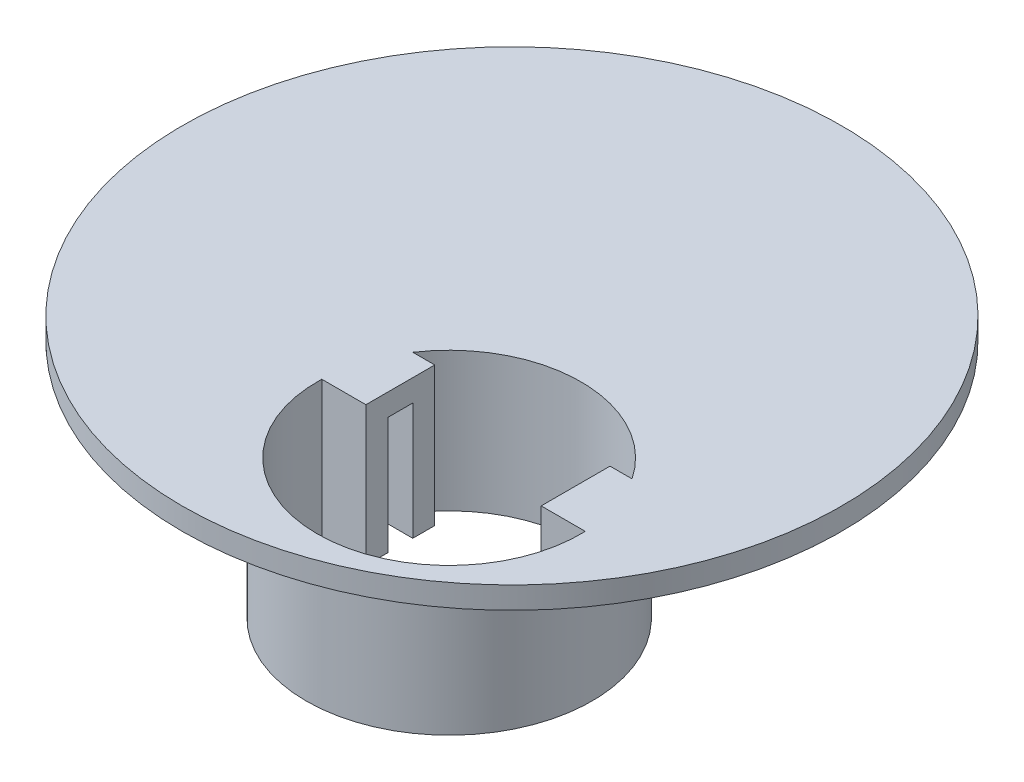
ISO-10303-21;
HEADER;
FILE_DESCRIPTION(('STEP AP214'),'2;1');
FILE_NAME('part.step','',(''),(''),'','','');
FILE_SCHEMA(('AUTOMOTIVE_DESIGN { 1 0 10303 214 1 1 1 1 }'));
ENDSEC;
DATA;
#1=APPLICATION_CONTEXT('core data for automotive mechanical design processes');
#2=APPLICATION_PROTOCOL_DEFINITION('international standard','automotive_design',2000,#1);
#3=PRODUCT_CONTEXT('',#1,'mechanical');
#4=PRODUCT('Part','Part','',(#3));
#5=PRODUCT_RELATED_PRODUCT_CATEGORY('part','',(#4));
#6=PRODUCT_DEFINITION_FORMATION('','',#4);
#7=PRODUCT_DEFINITION_CONTEXT('part definition',#1,'design');
#8=PRODUCT_DEFINITION('design','',#6,#7);
#9=PRODUCT_DEFINITION_SHAPE('','',#8);
#10=(LENGTH_UNIT() NAMED_UNIT(*) SI_UNIT(.MILLI.,.METRE.));
#11=(NAMED_UNIT(*) PLANE_ANGLE_UNIT() SI_UNIT($,.RADIAN.));
#12=(NAMED_UNIT(*) SI_UNIT($,.STERADIAN.) SOLID_ANGLE_UNIT());
#13=UNCERTAINTY_MEASURE_WITH_UNIT(LENGTH_MEASURE(1.E-05),#10,'distance_accuracy_value','');
#14=(GEOMETRIC_REPRESENTATION_CONTEXT(3) GLOBAL_UNCERTAINTY_ASSIGNED_CONTEXT((#13)) GLOBAL_UNIT_ASSIGNED_CONTEXT((#10,
#11,#12)) REPRESENTATION_CONTEXT('',''));
#15=CARTESIAN_POINT('',(0.,0.,0.));
#16=DIRECTION('',(0.,0.,1.));
#17=DIRECTION('',(1.,0.,0.));
#18=AXIS2_PLACEMENT_3D('',#15,#16,#17);
#19=CARTESIAN_POINT('',(0.,0.,0.));
#20=DIRECTION('',(0.,1.,0.));
#21=DIRECTION('',(0.,0.,1.));
#22=AXIS2_PLACEMENT_3D('',#19,#20,#21);
#23=PLANE('',#22);
#24=CARTESIAN_POINT('',(6.25000000000001,0.,10.5366626799906));
#25=DIRECTION('',(0.,1.,0.));
#26=DIRECTION('',(0.,0.,1.));
#27=AXIS2_PLACEMENT_3D('',#24,#25,#26);
#28=CIRCLE('',#27,9.);
#29=CARTESIAN_POINT('',(15.0681630740195,0.,8.73666267999059));
#30=VERTEX_POINT('',#29);
#31=CARTESIAN_POINT('',(14.5415619758885,0.,7.03666267999059));
#32=VERTEX_POINT('',#31);
#33=EDGE_CURVE('E49',#30,#32,#28,.T.);
#34=ORIENTED_EDGE('',*,*,#33,.F.);
#35=DIRECTION('',(-1.,0.,0.));
#36=VECTOR('',#35,1.);
#37=CARTESIAN_POINT('',(0.,0.,8.73666267999061));
#38=LINE('',#37,#36);
#39=CARTESIAN_POINT('',(12.2333147735479,0.,8.73666267999059));
#40=VERTEX_POINT('',#39);
#41=EDGE_CURVE('E176',#30,#40,#38,.T.);
#42=ORIENTED_EDGE('',*,*,#41,.T.);
#43=DIRECTION('',(0.,0.,1.));
#44=VECTOR('',#43,1.);
#45=CARTESIAN_POINT('',(12.2333147735479,0.,0.));
#46=LINE('',#45,#44);
#47=CARTESIAN_POINT('',(12.2333147735479,0.,7.03666267999059));
#48=VERTEX_POINT('',#47);
#49=EDGE_CURVE('E274',#48,#40,#46,.T.);
#50=ORIENTED_EDGE('',*,*,#49,.F.);
#51=DIRECTION('',(-1.,0.,0.));
#52=VECTOR('',#51,1.);
#53=CARTESIAN_POINT('',(0.,0.,7.03666267999061));
#54=LINE('',#53,#52);
#55=EDGE_CURVE('E54',#32,#48,#54,.T.);
#56=ORIENTED_EDGE('',*,*,#55,.F.);
#57=EDGE_LOOP('',(#34,#42,#50,#56));
#58=FACE_BOUND('',#57,.T.);
#59=ADVANCED_FACE('F34',(#58),#23,.F.);
#60=CARTESIAN_POINT('',(-2.04156197588849,0.,7.03666267999059));
#61=VERTEX_POINT('',#60);
#62=CARTESIAN_POINT('',(-2.56816307401943,0.,8.73666267999059));
#63=VERTEX_POINT('',#62);
#64=EDGE_CURVE('E219',#61,#63,#28,.T.);
#65=ORIENTED_EDGE('',*,*,#64,.F.);
#66=DIRECTION('',(1.,0.,0.));
#67=VECTOR('',#66,1.);
#68=CARTESIAN_POINT('',(0.,0.,7.03666267999059));
#69=LINE('',#68,#67);
#70=CARTESIAN_POINT('',(0.26668522645213,0.,7.03666267999059));
#71=VERTEX_POINT('',#70);
#72=EDGE_CURVE('E223',#61,#71,#69,.T.);
#73=ORIENTED_EDGE('',*,*,#72,.T.);
#74=DIRECTION('',(0.,0.,1.));
#75=VECTOR('',#74,1.);
#76=CARTESIAN_POINT('',(0.266685226452129,0.,0.));
#77=LINE('',#76,#75);
#78=CARTESIAN_POINT('',(0.266685226452131,0.,8.73666267999059));
#79=VERTEX_POINT('',#78);
#80=EDGE_CURVE('E252',#71,#79,#77,.T.);
#81=ORIENTED_EDGE('',*,*,#80,.T.);
#82=DIRECTION('',(1.,0.,0.));
#83=VECTOR('',#82,1.);
#84=CARTESIAN_POINT('',(0.,0.,8.73666267999059));
#85=LINE('',#84,#83);
#86=EDGE_CURVE('E220',#63,#79,#85,.T.);
#87=ORIENTED_EDGE('',*,*,#86,.F.);
#88=EDGE_LOOP('',(#65,#73,#81,#87));
#89=FACE_BOUND('',#88,.T.);
#90=ADVANCED_FACE('F306',(#89),#23,.F.);
#91=CARTESIAN_POINT('',(0.,1.5,10.2366626799906));
#92=DIRECTION('',(0.,0.,1.));
#93=DIRECTION('',(1.,0.,0.));
#94=AXIS2_PLACEMENT_3D('',#91,#92,#93);
#95=PLANE('',#94);
#96=DIRECTION('',(0.,-1.,0.));
#97=VECTOR('',#96,1.);
#98=CARTESIAN_POINT('',(-2.74499861033896,1.5,10.2366626799906));
#99=LINE('',#98,#97);
#100=CARTESIAN_POINT('',(-2.74499861033896,1.5,10.2366626799906));
#101=VERTEX_POINT('',#100);
#102=CARTESIAN_POINT('',(-2.74499861033896,-8.,10.2366626799906));
#103=VERTEX_POINT('',#102);
#104=EDGE_CURVE('E145',#101,#103,#99,.T.);
#105=ORIENTED_EDGE('',*,*,#104,.T.);
#106=DIRECTION('',(-1.,0.,0.));
#107=VECTOR('',#106,1.);
#108=CARTESIAN_POINT('',(0.,-8.,10.2366626799906));
#109=LINE('',#108,#107);
#110=CARTESIAN_POINT('',(0.266685226452131,-8.,10.2366626799906));
#111=VERTEX_POINT('',#110);
#112=EDGE_CURVE('E148',#111,#103,#109,.T.);
#113=ORIENTED_EDGE('',*,*,#112,.F.);
#114=DIRECTION('',(0.,-1.,0.));
#115=VECTOR('',#114,1.);
#116=CARTESIAN_POINT('',(0.266685226452131,1.5,10.2366626799906));
#117=LINE('',#116,#115);
#118=CARTESIAN_POINT('',(0.266685226452131,1.5,10.2366626799906));
#119=VERTEX_POINT('',#118);
#120=EDGE_CURVE('E290',#119,#111,#117,.T.);
#121=ORIENTED_EDGE('',*,*,#120,.F.);
#122=DIRECTION('',(-1.,0.,0.));
#123=VECTOR('',#122,1.);
#124=CARTESIAN_POINT('',(0.,1.5,10.2366626799906));
#125=LINE('',#124,#123);
#126=EDGE_CURVE('E150',#119,#101,#125,.T.);
#127=ORIENTED_EDGE('',*,*,#126,.T.);
#128=EDGE_LOOP('',(#105,#113,#121,#127));
#129=FACE_BOUND('',#128,.T.);
#130=ADVANCED_FACE('F147',(#129),#95,.T.);
#131=CARTESIAN_POINT('',(0.266685226452129,1.5,0.));
#132=DIRECTION('',(1.,0.,0.));
#133=DIRECTION('',(0.,0.,-1.));
#134=AXIS2_PLACEMENT_3D('',#131,#132,#133);
#135=PLANE('',#134);
#136=ORIENTED_EDGE('',*,*,#80,.F.);
#137=DIRECTION('',(0.,1.,0.));
#138=VECTOR('',#137,1.);
#139=CARTESIAN_POINT('',(0.26668522645213,-8.,7.03666267999059));
#140=LINE('',#139,#138);
#141=CARTESIAN_POINT('',(0.26668522645213,-8.,7.03666267999059));
#142=VERTEX_POINT('',#141);
#143=EDGE_CURVE('E239',#142,#71,#140,.T.);
#144=ORIENTED_EDGE('',*,*,#143,.F.);
#145=DIRECTION('',(0.,0.,1.));
#146=VECTOR('',#145,1.);
#147=CARTESIAN_POINT('',(0.266685226452129,-8.,0.));
#148=LINE('',#147,#146);
#149=CARTESIAN_POINT('',(0.26668522645213,-8.,5.53666267999059));
#150=VERTEX_POINT('',#149);
#151=EDGE_CURVE('E187',#150,#142,#148,.T.);
#152=ORIENTED_EDGE('',*,*,#151,.F.);
#153=DIRECTION('',(0.,-1.,0.));
#154=VECTOR('',#153,1.);
#155=CARTESIAN_POINT('',(0.26668522645213,1.5,5.53666267999059));
#156=LINE('',#155,#154);
#157=CARTESIAN_POINT('',(0.26668522645213,1.5,5.53666267999059));
#158=VERTEX_POINT('',#157);
#159=EDGE_CURVE('E288',#158,#150,#156,.T.);
#160=ORIENTED_EDGE('',*,*,#159,.F.);
#161=DIRECTION('',(0.,0.,1.));
#162=VECTOR('',#161,1.);
#163=CARTESIAN_POINT('',(0.266685226452129,1.5,0.));
#164=LINE('',#163,#162);
#165=EDGE_CURVE('E254',#158,#119,#164,.T.);
#166=ORIENTED_EDGE('',*,*,#165,.T.);
#167=ORIENTED_EDGE('',*,*,#120,.T.);
#168=DIRECTION('',(0.,0.,1.));
#169=VECTOR('',#168,1.);
#170=CARTESIAN_POINT('',(0.266685226452129,-8.,0.));
#171=LINE('',#170,#169);
#172=CARTESIAN_POINT('',(0.266685226452131,-8.,8.73666267999059));
#173=VERTEX_POINT('',#172);
#174=EDGE_CURVE('E167',#173,#111,#171,.T.);
#175=ORIENTED_EDGE('',*,*,#174,.F.);
#176=DIRECTION('',(0.,1.,0.));
#177=VECTOR('',#176,1.);
#178=CARTESIAN_POINT('',(0.266685226452131,-8.,8.73666267999059));
#179=LINE('',#178,#177);
#180=EDGE_CURVE('E217',#173,#79,#179,.T.);
#181=ORIENTED_EDGE('',*,*,#180,.T.);
#182=EDGE_LOOP('',(#136,#144,#152,#160,#166,#167,#175,#181));
#183=FACE_BOUND('',#182,.T.);
#184=ADVANCED_FACE('F356',(#183),#135,.T.);
#185=CARTESIAN_POINT('',(0.,1.5,5.53666267999059));
#186=DIRECTION('',(0.,0.,-1.));
#187=DIRECTION('',(-1.,0.,0.));
#188=AXIS2_PLACEMENT_3D('',#185,#186,#187);
#189=PLANE('',#188);
#190=ORIENTED_EDGE('',*,*,#159,.T.);
#191=DIRECTION('',(1.,0.,0.));
#192=VECTOR('',#191,1.);
#193=CARTESIAN_POINT('',(0.,-8.,5.53666267999059));
#194=LINE('',#193,#192);
#195=CARTESIAN_POINT('',(-1.23331477354787,-8.,5.53666267999059));
#196=VERTEX_POINT('',#195);
#197=EDGE_CURVE('E192',#196,#150,#194,.T.);
#198=ORIENTED_EDGE('',*,*,#197,.F.);
#199=DIRECTION('',(0.,-1.,0.));
#200=VECTOR('',#199,1.);
#201=CARTESIAN_POINT('',(-1.23331477354787,1.5,5.53666267999059));
#202=LINE('',#201,#200);
#203=CARTESIAN_POINT('',(-1.23331477354787,1.5,5.53666267999059));
#204=VERTEX_POINT('',#203);
#205=EDGE_CURVE('E286',#204,#196,#202,.T.);
#206=ORIENTED_EDGE('',*,*,#205,.F.);
#207=DIRECTION('',(1.,0.,0.));
#208=VECTOR('',#207,1.);
#209=CARTESIAN_POINT('',(0.,1.5,5.53666267999059));
#210=LINE('',#209,#208);
#211=EDGE_CURVE('E258',#204,#158,#210,.T.);
#212=ORIENTED_EDGE('',*,*,#211,.T.);
#213=EDGE_LOOP('',(#190,#198,#206,#212));
#214=FACE_BOUND('',#213,.T.);
#215=ADVANCED_FACE('F353',(#214),#189,.T.);
#216=CARTESIAN_POINT('',(6.25000000000001,1.5,10.5366626799906));
#217=DIRECTION('',(0.,-1.,0.));
#218=DIRECTION('',(0.,0.,-1.));
#219=AXIS2_PLACEMENT_3D('',#216,#217,#218);
#220=CYLINDRICAL_SURFACE('',#219,9.);
#221=ORIENTED_EDGE('',*,*,#205,.T.);
#222=CARTESIAN_POINT('',(6.25000000000001,-8.,10.5366626799906));
#223=DIRECTION('',(0.,1.,0.));
#224=DIRECTION('',(0.,0.,1.));
#225=AXIS2_PLACEMENT_3D('',#222,#223,#224);
#226=CIRCLE('',#225,9.);
#227=CARTESIAN_POINT('',(13.7333147735479,-8.,5.53666267999059));
#228=VERTEX_POINT('',#227);
#229=EDGE_CURVE('E180',#228,#196,#226,.T.);
#230=ORIENTED_EDGE('',*,*,#229,.F.);
#231=DIRECTION('',(0.,-1.,0.));
#232=VECTOR('',#231,1.);
#233=CARTESIAN_POINT('',(13.7333147735479,1.5,5.53666267999059));
#234=LINE('',#233,#232);
#235=CARTESIAN_POINT('',(13.7333147735479,1.5,5.53666267999059));
#236=VERTEX_POINT('',#235);
#237=EDGE_CURVE('E284',#236,#228,#234,.T.);
#238=ORIENTED_EDGE('',*,*,#237,.F.);
#239=CARTESIAN_POINT('',(6.25000000000001,1.5,10.5366626799906));
#240=DIRECTION('',(0.,1.,0.));
#241=DIRECTION('',(0.,0.,1.));
#242=AXIS2_PLACEMENT_3D('',#239,#240,#241);
#243=CIRCLE('',#242,9.);
#244=EDGE_CURVE('E261',#236,#204,#243,.T.);
#245=ORIENTED_EDGE('',*,*,#244,.T.);
#246=EDGE_LOOP('',(#221,#230,#238,#245));
#247=FACE_BOUND('',#246,.T.);
#248=ADVANCED_FACE('F339',(#247),#220,.F.);
#249=CARTESIAN_POINT('',(0.,1.5,5.53666267999062));
#250=DIRECTION('',(0.,0.,1.));
#251=DIRECTION('',(1.,0.,0.));
#252=AXIS2_PLACEMENT_3D('',#249,#250,#251);
#253=PLANE('',#252);
#254=ORIENTED_EDGE('',*,*,#237,.T.);
#255=DIRECTION('',(-1.,0.,0.));
#256=VECTOR('',#255,1.);
#257=CARTESIAN_POINT('',(0.,-8.,5.53666267999062));
#258=LINE('',#257,#256);
#259=CARTESIAN_POINT('',(12.2333147735479,-8.,5.53666267999059));
#260=VERTEX_POINT('',#259);
#261=EDGE_CURVE('E191',#228,#260,#258,.T.);
#262=ORIENTED_EDGE('',*,*,#261,.T.);
#263=DIRECTION('',(0.,-1.,0.));
#264=VECTOR('',#263,1.);
#265=CARTESIAN_POINT('',(12.2333147735479,1.5,5.53666267999059));
#266=LINE('',#265,#264);
#267=CARTESIAN_POINT('',(12.2333147735479,1.5,5.53666267999059));
#268=VERTEX_POINT('',#267);
#269=EDGE_CURVE('E282',#268,#260,#266,.T.);
#270=ORIENTED_EDGE('',*,*,#269,.F.);
#271=DIRECTION('',(-1.,0.,0.));
#272=VECTOR('',#271,1.);
#273=CARTESIAN_POINT('',(0.,1.5,5.53666267999062));
#274=LINE('',#273,#272);
#275=EDGE_CURVE('E264',#236,#268,#274,.T.);
#276=ORIENTED_EDGE('',*,*,#275,.F.);
#277=EDGE_LOOP('',(#254,#262,#270,#276));
#278=FACE_BOUND('',#277,.T.);
#279=ADVANCED_FACE('F348',(#278),#253,.F.);
#280=CARTESIAN_POINT('',(12.2333147735479,1.5,0.));
#281=DIRECTION('',(1.,0.,0.));
#282=DIRECTION('',(0.,0.,-1.));
#283=AXIS2_PLACEMENT_3D('',#280,#281,#282);
#284=PLANE('',#283);
#285=ORIENTED_EDGE('',*,*,#269,.T.);
#286=DIRECTION('',(0.,0.,1.));
#287=VECTOR('',#286,1.);
#288=CARTESIAN_POINT('',(12.2333147735479,-8.,0.));
#289=LINE('',#288,#287);
#290=CARTESIAN_POINT('',(12.2333147735479,-8.,7.03666267999059));
#291=VERTEX_POINT('',#290);
#292=EDGE_CURVE('E198',#260,#291,#289,.T.);
#293=ORIENTED_EDGE('',*,*,#292,.T.);
#294=DIRECTION('',(0.,1.,0.));
#295=VECTOR('',#294,1.);
#296=CARTESIAN_POINT('',(12.2333147735479,-8.,7.03666267999059));
#297=LINE('',#296,#295);
#298=EDGE_CURVE('E236',#291,#48,#297,.T.);
#299=ORIENTED_EDGE('',*,*,#298,.T.);
#300=ORIENTED_EDGE('',*,*,#49,.T.);
#301=DIRECTION('',(0.,1.,0.));
#302=VECTOR('',#301,1.);
#303=CARTESIAN_POINT('',(12.2333147735479,-8.,8.73666267999059));
#304=LINE('',#303,#302);
#305=CARTESIAN_POINT('',(12.2333147735479,-8.,8.73666267999059));
#306=VERTEX_POINT('',#305);
#307=EDGE_CURVE('E227',#306,#40,#304,.T.);
#308=ORIENTED_EDGE('',*,*,#307,.F.);
#309=DIRECTION('',(0.,0.,1.));
#310=VECTOR('',#309,1.);
#311=CARTESIAN_POINT('',(12.2333147735479,-8.,0.));
#312=LINE('',#311,#310);
#313=CARTESIAN_POINT('',(12.2333147735479,-8.,10.2366626799906));
#314=VERTEX_POINT('',#313);
#315=EDGE_CURVE('E209',#306,#314,#312,.T.);
#316=ORIENTED_EDGE('',*,*,#315,.T.);
#317=DIRECTION('',(0.,-1.,0.));
#318=VECTOR('',#317,1.);
#319=CARTESIAN_POINT('',(12.2333147735479,1.5,10.2366626799906));
#320=LINE('',#319,#318);
#321=CARTESIAN_POINT('',(12.2333147735479,1.5,10.2366626799906));
#322=VERTEX_POINT('',#321);
#323=EDGE_CURVE('E280',#322,#314,#320,.T.);
#324=ORIENTED_EDGE('',*,*,#323,.F.);
#325=DIRECTION('',(0.,0.,1.));
#326=VECTOR('',#325,1.);
#327=CARTESIAN_POINT('',(12.2333147735479,1.5,0.));
#328=LINE('',#327,#326);
#329=EDGE_CURVE('E267',#268,#322,#328,.T.);
#330=ORIENTED_EDGE('',*,*,#329,.F.);
#331=EDGE_LOOP('',(#285,#293,#299,#300,#308,#316,#324,#330));
#332=FACE_BOUND('',#331,.T.);
#333=ADVANCED_FACE('F344',(#332),#284,.F.);
#334=CARTESIAN_POINT('',(0.,1.5,10.2366626799906));
#335=DIRECTION('',(0.,0.,-1.));
#336=DIRECTION('',(-1.,0.,0.));
#337=AXIS2_PLACEMENT_3D('',#334,#335,#336);
#338=PLANE('',#337);
#339=ORIENTED_EDGE('',*,*,#323,.T.);
#340=DIRECTION('',(1.,0.,0.));
#341=VECTOR('',#340,1.);
#342=CARTESIAN_POINT('',(0.,-8.,10.2366626799906));
#343=LINE('',#342,#341);
#344=CARTESIAN_POINT('',(15.244998610339,-8.,10.2366626799906));
#345=VERTEX_POINT('',#344);
#346=EDGE_CURVE('E212',#314,#345,#343,.T.);
#347=ORIENTED_EDGE('',*,*,#346,.T.);
#348=DIRECTION('',(0.,-1.,0.));
#349=VECTOR('',#348,1.);
#350=CARTESIAN_POINT('',(15.244998610339,1.5,10.2366626799906));
#351=LINE('',#350,#349);
#352=CARTESIAN_POINT('',(15.244998610339,1.5,10.2366626799906));
#353=VERTEX_POINT('',#352);
#354=EDGE_CURVE('E155',#353,#345,#351,.T.);
#355=ORIENTED_EDGE('',*,*,#354,.F.);
#356=DIRECTION('',(1.,0.,0.));
#357=VECTOR('',#356,1.);
#358=CARTESIAN_POINT('',(0.,1.5,10.2366626799906));
#359=LINE('',#358,#357);
#360=EDGE_CURVE('E269',#322,#353,#359,.T.);
#361=ORIENTED_EDGE('',*,*,#360,.F.);
#362=EDGE_LOOP('',(#339,#347,#355,#361));
#363=FACE_BOUND('',#362,.T.);
#364=ADVANCED_FACE('F337',(#363),#338,.F.);
#365=ORIENTED_EDGE('',*,*,#354,.T.);
#366=EDGE_CURVE('E164',#103,#345,#226,.T.);
#367=ORIENTED_EDGE('',*,*,#366,.F.);
#368=ORIENTED_EDGE('',*,*,#104,.F.);
#369=EDGE_CURVE('E265',#101,#353,#243,.T.);
#370=ORIENTED_EDGE('',*,*,#369,.T.);
#371=EDGE_LOOP('',(#365,#367,#368,#370));
#372=FACE_BOUND('',#371,.T.);
#373=ADVANCED_FACE('F169',(#372),#220,.F.);
#374=CARTESIAN_POINT('',(0.,1.5,0.));
#375=DIRECTION('',(0.,-1.,0.));
#376=DIRECTION('',(0.,0.,-1.));
#377=AXIS2_PLACEMENT_3D('',#374,#375,#376);
#378=CYLINDRICAL_SURFACE('',#377,22.5);
#379=CARTESIAN_POINT('',(0.,1.5,0.));
#380=DIRECTION('',(0.,1.,0.));
#381=DIRECTION('',(0.,0.,1.));
#382=AXIS2_PLACEMENT_3D('',#379,#380,#381);
#383=CIRCLE('',#382,22.5);
#384=CARTESIAN_POINT('',(0.,1.5,22.5));
#385=VERTEX_POINT('',#384);
#386=EDGE_CURVE('E156',#385,#385,#383,.T.);
#387=ORIENTED_EDGE('',*,*,#386,.F.);
#388=EDGE_LOOP('',(#387));
#389=FACE_BOUND('',#388,.T.);
#390=CARTESIAN_POINT('',(0.,0.,0.));
#391=DIRECTION('',(0.,1.,0.));
#392=DIRECTION('',(0.,0.,1.));
#393=AXIS2_PLACEMENT_3D('',#390,#391,#392);
#394=CIRCLE('',#393,22.5);
#395=CARTESIAN_POINT('',(0.,0.,22.5));
#396=VERTEX_POINT('',#395);
#397=EDGE_CURVE('E255',#396,#396,#394,.T.);
#398=ORIENTED_EDGE('',*,*,#397,.T.);
#399=EDGE_LOOP('',(#398));
#400=FACE_BOUND('',#399,.T.);
#401=ADVANCED_FACE('F324',(#389,#400),#378,.T.);
#402=CARTESIAN_POINT('',(0.,1.5,0.));
#403=DIRECTION('',(0.,1.,0.));
#404=DIRECTION('',(0.,0.,1.));
#405=AXIS2_PLACEMENT_3D('',#402,#403,#404);
#406=PLANE('',#405);
#407=ORIENTED_EDGE('',*,*,#126,.F.);
#408=ORIENTED_EDGE('',*,*,#165,.F.);
#409=ORIENTED_EDGE('',*,*,#211,.F.);
#410=ORIENTED_EDGE('',*,*,#244,.F.);
#411=ORIENTED_EDGE('',*,*,#275,.T.);
#412=ORIENTED_EDGE('',*,*,#329,.T.);
#413=ORIENTED_EDGE('',*,*,#360,.T.);
#414=ORIENTED_EDGE('',*,*,#369,.F.);
#415=EDGE_LOOP('',(#407,#408,#409,#410,#411,#412,#413,#414));
#416=FACE_BOUND('',#415,.T.);
#417=ORIENTED_EDGE('',*,*,#386,.T.);
#418=EDGE_LOOP('',(#417));
#419=FACE_BOUND('',#418,.T.);
#420=ADVANCED_FACE('F316',(#416,#419),#406,.T.);
#421=CARTESIAN_POINT('',(6.25000000000001,0.,10.5366626799906));
#422=DIRECTION('',(0.,1.,0.));
#423=DIRECTION('',(0.,0.,1.));
#424=AXIS2_PLACEMENT_3D('',#421,#422,#423);
#425=CIRCLE('',#424,9.76179025081622);
#426=CARTESIAN_POINT('',(6.25000000000001,0.,20.2984529308068));
#427=VERTEX_POINT('',#426);
#428=EDGE_CURVE('E171',#427,#427,#425,.T.);
#429=ORIENTED_EDGE('',*,*,#428,.T.);
#430=EDGE_LOOP('',(#429));
#431=FACE_BOUND('',#430,.T.);
#432=CARTESIAN_POINT('',(-13.75,0.,-8.9633373200094));
#433=DIRECTION('',(0.,1.,0.));
#434=DIRECTION('',(0.,0.,1.));
#435=AXIS2_PLACEMENT_3D('',#432,#433,#434);
#436=CIRCLE('',#435,2.55);
#437=CARTESIAN_POINT('',(-13.75,0.,-6.4133373200094));
#438=VERTEX_POINT('',#437);
#439=EDGE_CURVE('E230',#438,#438,#436,.T.);
#440=ORIENTED_EDGE('',*,*,#439,.T.);
#441=EDGE_LOOP('',(#440));
#442=FACE_BOUND('',#441,.T.);
#443=ORIENTED_EDGE('',*,*,#397,.F.);
#444=EDGE_LOOP('',(#443));
#445=FACE_BOUND('',#444,.T.);
#446=ADVANCED_FACE('F308',(#431,#442,#445),#23,.F.);
#447=CARTESIAN_POINT('',(-13.75,-8.,-8.9633373200094));
#448=DIRECTION('',(0.,1.,0.));
#449=DIRECTION('',(0.,0.,1.));
#450=AXIS2_PLACEMENT_3D('',#447,#448,#449);
#451=CYLINDRICAL_SURFACE('',#450,2.55);
#452=CARTESIAN_POINT('',(-13.75,-7.,-8.9633373200094));
#453=DIRECTION('',(0.,1.,0.));
#454=DIRECTION('',(0.,0.,1.));
#455=AXIS2_PLACEMENT_3D('',#452,#453,#454);
#456=CIRCLE('',#455,2.55);
#457=CARTESIAN_POINT('',(-13.75,-7.,-6.4133373200094));
#458=VERTEX_POINT('',#457);
#459=EDGE_CURVE('E42',#458,#458,#456,.T.);
#460=ORIENTED_EDGE('',*,*,#459,.T.);
#461=EDGE_LOOP('',(#460));
#462=FACE_BOUND('',#461,.T.);
#463=ORIENTED_EDGE('',*,*,#439,.F.);
#464=EDGE_LOOP('',(#463));
#465=FACE_BOUND('',#464,.T.);
#466=ADVANCED_FACE('F294',(#462,#465),#451,.T.);
#467=CARTESIAN_POINT('',(0.,-8.,0.));
#468=DIRECTION('',(0.,1.,0.));
#469=DIRECTION('',(0.,0.,1.));
#470=AXIS2_PLACEMENT_3D('',#467,#468,#469);
#471=PLANE('',#470);
#472=CARTESIAN_POINT('',(-13.75,-8.,-8.9633373200094));
#473=DIRECTION('',(0.,1.,0.));
#474=DIRECTION('',(0.,0.,1.));
#475=AXIS2_PLACEMENT_3D('',#472,#473,#474);
#476=CIRCLE('',#475,1.55);
#477=CARTESIAN_POINT('',(-13.75,-8.,-7.4133373200094));
#478=VERTEX_POINT('',#477);
#479=EDGE_CURVE('E11',#478,#478,#476,.F.);
#480=ORIENTED_EDGE('',*,*,#479,.T.);
#481=EDGE_LOOP('',(#480));
#482=FACE_BOUND('',#481,.T.);
#483=ADVANCED_FACE('F322',(#482),#471,.F.);
#484=CARTESIAN_POINT('',(0.,-8.,8.73666267999061));
#485=DIRECTION('',(0.,0.,-1.));
#486=DIRECTION('',(-1.,0.,0.));
#487=AXIS2_PLACEMENT_3D('',#484,#485,#486);
#488=PLANE('',#487);
#489=ORIENTED_EDGE('',*,*,#41,.F.);
#490=DIRECTION('',(0.,1.,0.));
#491=VECTOR('',#490,1.);
#492=CARTESIAN_POINT('',(15.0681630740195,-8.,8.73666267999059));
#493=LINE('',#492,#491);
#494=CARTESIAN_POINT('',(15.0681630740195,-8.,8.73666267999059));
#495=VERTEX_POINT('',#494);
#496=EDGE_CURVE('E231',#495,#30,#493,.T.);
#497=ORIENTED_EDGE('',*,*,#496,.F.);
#498=DIRECTION('',(-1.,0.,0.));
#499=VECTOR('',#498,1.);
#500=CARTESIAN_POINT('',(0.,-8.,8.73666267999061));
#501=LINE('',#500,#499);
#502=EDGE_CURVE('E178',#495,#306,#501,.T.);
#503=ORIENTED_EDGE('',*,*,#502,.T.);
#504=ORIENTED_EDGE('',*,*,#307,.T.);
#505=EDGE_LOOP('',(#489,#497,#503,#504));
#506=FACE_BOUND('',#505,.T.);
#507=ADVANCED_FACE('F408',(#506),#488,.T.);
#508=CARTESIAN_POINT('',(6.25000000000001,-8.,10.5366626799906));
#509=DIRECTION('',(0.,1.,0.));
#510=DIRECTION('',(0.,0.,1.));
#511=AXIS2_PLACEMENT_3D('',#508,#509,#510);
#512=CYLINDRICAL_SURFACE('',#511,9.);
#513=ORIENTED_EDGE('',*,*,#33,.T.);
#514=DIRECTION('',(0.,1.,0.));
#515=VECTOR('',#514,1.);
#516=CARTESIAN_POINT('',(14.5415619758885,-8.,7.03666267999059));
#517=LINE('',#516,#515);
#518=CARTESIAN_POINT('',(14.5415619758885,-8.,7.03666267999059));
#519=VERTEX_POINT('',#518);
#520=EDGE_CURVE('E233',#519,#32,#517,.T.);
#521=ORIENTED_EDGE('',*,*,#520,.F.);
#522=EDGE_CURVE('E173',#495,#519,#226,.T.);
#523=ORIENTED_EDGE('',*,*,#522,.F.);
#524=ORIENTED_EDGE('',*,*,#496,.T.);
#525=EDGE_LOOP('',(#513,#521,#523,#524));
#526=FACE_BOUND('',#525,.T.);
#527=ADVANCED_FACE('F413',(#526),#512,.F.);
#528=CARTESIAN_POINT('',(0.,-8.,7.03666267999061));
#529=DIRECTION('',(0.,0.,-1.));
#530=DIRECTION('',(-1.,0.,0.));
#531=AXIS2_PLACEMENT_3D('',#528,#529,#530);
#532=PLANE('',#531);
#533=ORIENTED_EDGE('',*,*,#55,.T.);
#534=ORIENTED_EDGE('',*,*,#298,.F.);
#535=DIRECTION('',(-1.,0.,0.));
#536=VECTOR('',#535,1.);
#537=CARTESIAN_POINT('',(0.,-8.,7.03666267999061));
#538=LINE('',#537,#536);
#539=EDGE_CURVE('E179',#519,#291,#538,.T.);
#540=ORIENTED_EDGE('',*,*,#539,.F.);
#541=ORIENTED_EDGE('',*,*,#520,.T.);
#542=EDGE_LOOP('',(#533,#534,#540,#541));
#543=FACE_BOUND('',#542,.T.);
#544=ADVANCED_FACE('F425',(#543),#532,.F.);
#545=CARTESIAN_POINT('',(0.,-8.,7.03666267999059));
#546=DIRECTION('',(0.,0.,1.));
#547=DIRECTION('',(1.,0.,0.));
#548=AXIS2_PLACEMENT_3D('',#545,#546,#547);
#549=PLANE('',#548);
#550=ORIENTED_EDGE('',*,*,#72,.F.);
#551=DIRECTION('',(0.,1.,0.));
#552=VECTOR('',#551,1.);
#553=CARTESIAN_POINT('',(-2.04156197588848,-8.,7.03666267999059));
#554=LINE('',#553,#552);
#555=CARTESIAN_POINT('',(-2.04156197588848,-8.,7.03666267999059));
#556=VERTEX_POINT('',#555);
#557=EDGE_CURVE('E242',#556,#61,#554,.T.);
#558=ORIENTED_EDGE('',*,*,#557,.F.);
#559=DIRECTION('',(1.,0.,0.));
#560=VECTOR('',#559,1.);
#561=CARTESIAN_POINT('',(0.,-8.,7.03666267999059));
#562=LINE('',#561,#560);
#563=EDGE_CURVE('E181',#556,#142,#562,.T.);
#564=ORIENTED_EDGE('',*,*,#563,.T.);
#565=ORIENTED_EDGE('',*,*,#143,.T.);
#566=EDGE_LOOP('',(#550,#558,#564,#565));
#567=FACE_BOUND('',#566,.T.);
#568=ADVANCED_FACE('F436',(#567),#549,.T.);
#569=ORIENTED_EDGE('',*,*,#64,.T.);
#570=DIRECTION('',(0.,1.,0.));
#571=VECTOR('',#570,1.);
#572=CARTESIAN_POINT('',(-2.56816307401943,-8.,8.73666267999059));
#573=LINE('',#572,#571);
#574=CARTESIAN_POINT('',(-2.56816307401943,-8.,8.73666267999059));
#575=VERTEX_POINT('',#574);
#576=EDGE_CURVE('E245',#575,#63,#573,.T.);
#577=ORIENTED_EDGE('',*,*,#576,.F.);
#578=EDGE_CURVE('E174',#556,#575,#226,.T.);
#579=ORIENTED_EDGE('',*,*,#578,.F.);
#580=ORIENTED_EDGE('',*,*,#557,.T.);
#581=EDGE_LOOP('',(#569,#577,#579,#580));
#582=FACE_BOUND('',#581,.T.);
#583=ADVANCED_FACE('F428',(#582),#512,.F.);
#584=CARTESIAN_POINT('',(0.,-8.,8.73666267999059));
#585=DIRECTION('',(0.,0.,1.));
#586=DIRECTION('',(1.,0.,0.));
#587=AXIS2_PLACEMENT_3D('',#584,#585,#586);
#588=PLANE('',#587);
#589=ORIENTED_EDGE('',*,*,#86,.T.);
#590=ORIENTED_EDGE('',*,*,#180,.F.);
#591=DIRECTION('',(1.,0.,0.));
#592=VECTOR('',#591,1.);
#593=CARTESIAN_POINT('',(0.,-8.,8.73666267999059));
#594=LINE('',#593,#592);
#595=EDGE_CURVE('E182',#575,#173,#594,.T.);
#596=ORIENTED_EDGE('',*,*,#595,.F.);
#597=ORIENTED_EDGE('',*,*,#576,.T.);
#598=EDGE_LOOP('',(#589,#590,#596,#597));
#599=FACE_BOUND('',#598,.T.);
#600=ADVANCED_FACE('F455',(#599),#588,.F.);
#601=CARTESIAN_POINT('',(6.25000000000001,-8.,10.5366626799906));
#602=DIRECTION('',(0.,1.,0.));
#603=DIRECTION('',(0.,0.,1.));
#604=AXIS2_PLACEMENT_3D('',#601,#602,#603);
#605=CYLINDRICAL_SURFACE('',#604,9.76179025081622);
#606=CARTESIAN_POINT('',(6.25000000000001,-8.,10.5366626799906));
#607=DIRECTION('',(0.,1.,0.));
#608=DIRECTION('',(0.,0.,1.));
#609=AXIS2_PLACEMENT_3D('',#606,#607,#608);
#610=CIRCLE('',#609,9.76179025081622);
#611=CARTESIAN_POINT('',(6.25000000000001,-8.,20.2984529308068));
#612=VERTEX_POINT('',#611);
#613=EDGE_CURVE('E214',#612,#612,#610,.T.);
#614=ORIENTED_EDGE('',*,*,#613,.T.);
#615=EDGE_LOOP('',(#614));
#616=FACE_BOUND('',#615,.T.);
#617=ORIENTED_EDGE('',*,*,#428,.F.);
#618=EDGE_LOOP('',(#617));
#619=FACE_BOUND('',#618,.T.);
#620=ADVANCED_FACE('F302',(#616,#619),#605,.T.);
#621=CARTESIAN_POINT('',(0.,-8.,0.));
#622=DIRECTION('',(0.,1.,0.));
#623=DIRECTION('',(0.,0.,1.));
#624=AXIS2_PLACEMENT_3D('',#621,#622,#623);
#625=PLANE('',#624);
#626=ORIENTED_EDGE('',*,*,#366,.T.);
#627=ORIENTED_EDGE('',*,*,#346,.F.);
#628=ORIENTED_EDGE('',*,*,#315,.F.);
#629=ORIENTED_EDGE('',*,*,#502,.F.);
#630=ORIENTED_EDGE('',*,*,#522,.T.);
#631=ORIENTED_EDGE('',*,*,#539,.T.);
#632=ORIENTED_EDGE('',*,*,#292,.F.);
#633=ORIENTED_EDGE('',*,*,#261,.F.);
#634=ORIENTED_EDGE('',*,*,#229,.T.);
#635=ORIENTED_EDGE('',*,*,#197,.T.);
#636=ORIENTED_EDGE('',*,*,#151,.T.);
#637=ORIENTED_EDGE('',*,*,#563,.F.);
#638=ORIENTED_EDGE('',*,*,#578,.T.);
#639=ORIENTED_EDGE('',*,*,#595,.T.);
#640=ORIENTED_EDGE('',*,*,#174,.T.);
#641=ORIENTED_EDGE('',*,*,#112,.T.);
#642=EDGE_LOOP('',(#626,#627,#628,#629,#630,#631,#632,#633,#634,#635,#636,#637,#638,#639,#640,#641));
#643=FACE_BOUND('',#642,.T.);
#644=ORIENTED_EDGE('',*,*,#613,.F.);
#645=EDGE_LOOP('',(#644));
#646=FACE_BOUND('',#645,.T.);
#647=ADVANCED_FACE('F161',(#643,#646),#625,.F.);
#648=CARTESIAN_POINT('',(-13.75,-7.,-8.9633373200094));
#649=DIRECTION('',(0.,1.,0.));
#650=DIRECTION('',(0.,0.,1.));
#651=AXIS2_PLACEMENT_3D('',#648,#649,#650);
#652=TOROIDAL_SURFACE('',#651,1.55,1.);
#653=ORIENTED_EDGE('',*,*,#479,.F.);
#654=EDGE_LOOP('',(#653));
#655=FACE_BOUND('',#654,.T.);
#656=ORIENTED_EDGE('',*,*,#459,.F.);
#657=EDGE_LOOP('',(#656));
#658=FACE_BOUND('',#657,.T.);
#659=ADVANCED_FACE('F36',(#655,#658),#652,.T.);
#660=CLOSED_SHELL('',(#59,#90,#130,#184,#215,#248,#279,#333,#364,#373,#401,#420,#446,#466,#483,
#507,#527,#544,#568,#583,#600,#620,#647,#659));
#661=MANIFOLD_SOLID_BREP('B2',#660);
#662=ADVANCED_BREP_SHAPE_REPRESENTATION('',(#18,#661),#14);
#663=SHAPE_DEFINITION_REPRESENTATION(#9,#662);
ENDSEC;
END-ISO-10303-21;
